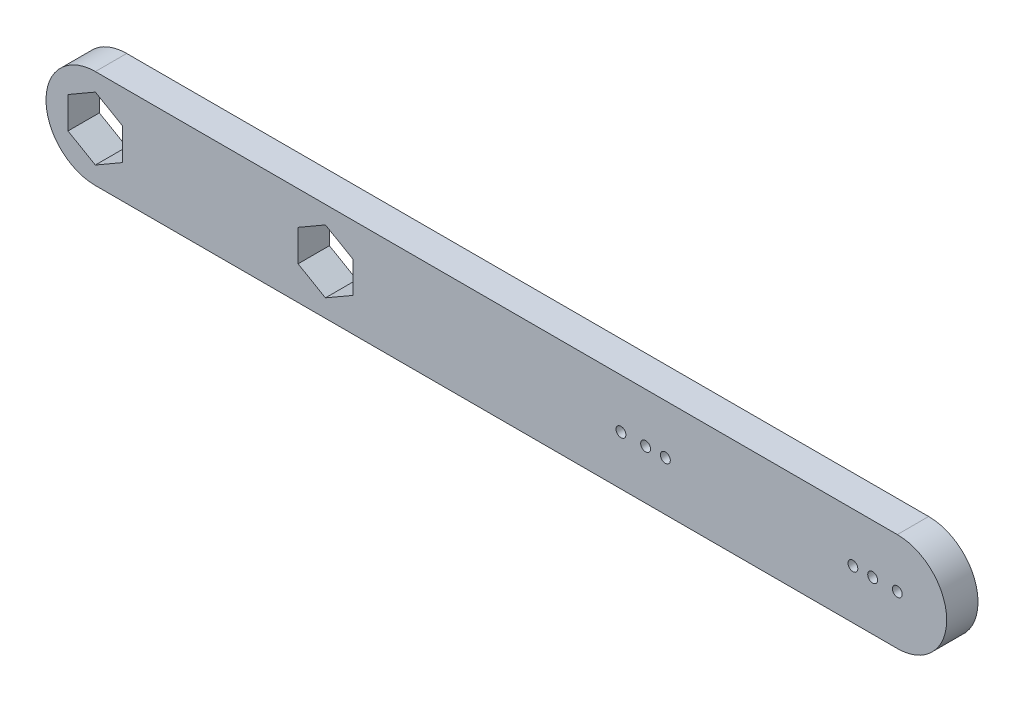
ISO-10303-21;
HEADER;
FILE_DESCRIPTION(('STEP AP214'),'2;1');
FILE_NAME('part.step','',(''),(''),'','','');
FILE_SCHEMA(('AUTOMOTIVE_DESIGN { 1 0 10303 214 1 1 1 1 }'));
ENDSEC;
DATA;
#1=APPLICATION_CONTEXT('core data for automotive mechanical design processes');
#2=APPLICATION_PROTOCOL_DEFINITION('international standard','automotive_design',2000,#1);
#3=PRODUCT_CONTEXT('',#1,'mechanical');
#4=PRODUCT('Part','Part','',(#3));
#5=PRODUCT_RELATED_PRODUCT_CATEGORY('part','',(#4));
#6=PRODUCT_DEFINITION_FORMATION('','',#4);
#7=PRODUCT_DEFINITION_CONTEXT('part definition',#1,'design');
#8=PRODUCT_DEFINITION('design','',#6,#7);
#9=PRODUCT_DEFINITION_SHAPE('','',#8);
#10=(LENGTH_UNIT() NAMED_UNIT(*) SI_UNIT(.MILLI.,.METRE.));
#11=(NAMED_UNIT(*) PLANE_ANGLE_UNIT() SI_UNIT($,.RADIAN.));
#12=(NAMED_UNIT(*) SI_UNIT($,.STERADIAN.) SOLID_ANGLE_UNIT());
#13=UNCERTAINTY_MEASURE_WITH_UNIT(LENGTH_MEASURE(1.E-05),#10,'distance_accuracy_value','');
#14=(GEOMETRIC_REPRESENTATION_CONTEXT(3) GLOBAL_UNCERTAINTY_ASSIGNED_CONTEXT((#13)) GLOBAL_UNIT_ASSIGNED_CONTEXT((#10,
#11,#12)) REPRESENTATION_CONTEXT('',''));
#15=CARTESIAN_POINT('',(0.,0.,0.));
#16=DIRECTION('',(0.,0.,1.));
#17=DIRECTION('',(1.,0.,0.));
#18=AXIS2_PLACEMENT_3D('',#15,#16,#17);
#19=CARTESIAN_POINT('',(0.,0.,3.175));
#20=DIRECTION('',(0.,0.,1.));
#21=DIRECTION('',(1.,0.,0.));
#22=AXIS2_PLACEMENT_3D('',#19,#20,#21);
#23=PLANE('',#22);
#24=CARTESIAN_POINT('',(55.75,0.,3.175));
#25=DIRECTION('',(0.,0.,1.));
#26=DIRECTION('',(1.,0.,0.));
#27=AXIS2_PLACEMENT_3D('',#24,#25,#26);
#28=CIRCLE('',#27,0.499999999999999);
#29=CARTESIAN_POINT('',(56.25,0.,3.175));
#30=VERTEX_POINT('',#29);
#31=EDGE_CURVE('E466',#30,#30,#28,.T.);
#32=ORIENTED_EDGE('',*,*,#31,.F.);
#33=EDGE_LOOP('',(#32));
#34=FACE_BOUND('',#33,.T.);
#35=CARTESIAN_POINT('',(57.75,0.,3.175));
#36=DIRECTION('',(0.,0.,1.));
#37=DIRECTION('',(1.,0.,0.));
#38=AXIS2_PLACEMENT_3D('',#35,#36,#37);
#39=CIRCLE('',#38,0.499999999999999);
#40=CARTESIAN_POINT('',(58.25,0.,3.175));
#41=VERTEX_POINT('',#40);
#42=EDGE_CURVE('E482',#41,#41,#39,.T.);
#43=ORIENTED_EDGE('',*,*,#42,.F.);
#44=EDGE_LOOP('',(#43));
#45=FACE_BOUND('',#44,.T.);
#46=CARTESIAN_POINT('',(81.25,0.,3.175));
#47=DIRECTION('',(0.,0.,1.));
#48=DIRECTION('',(1.,0.,0.));
#49=AXIS2_PLACEMENT_3D('',#46,#47,#48);
#50=CIRCLE('',#49,0.499999999999999);
#51=CARTESIAN_POINT('',(81.75,0.,3.175));
#52=VERTEX_POINT('',#51);
#53=EDGE_CURVE('E195',#52,#52,#50,.T.);
#54=ORIENTED_EDGE('',*,*,#53,.F.);
#55=EDGE_LOOP('',(#54));
#56=FACE_BOUND('',#55,.T.);
#57=CARTESIAN_POINT('',(0.,0.,3.175));
#58=DIRECTION('',(0.,0.,1.));
#59=DIRECTION('',(1.,0.,0.));
#60=AXIS2_PLACEMENT_3D('',#57,#58,#59);
#61=CIRCLE('',#60,4.99999999999998);
#62=CARTESIAN_POINT('',(0.,4.99999999999998,3.175));
#63=VERTEX_POINT('',#62);
#64=CARTESIAN_POINT('',(0.,-4.99999999999998,3.175));
#65=VERTEX_POINT('',#64);
#66=EDGE_CURVE('E288',#63,#65,#61,.T.);
#67=ORIENTED_EDGE('',*,*,#66,.T.);
#68=DIRECTION('',(1.,0.,0.));
#69=VECTOR('',#68,1.);
#70=CARTESIAN_POINT('',(0.,-4.99999999999998,3.175));
#71=LINE('',#70,#69);
#72=CARTESIAN_POINT('',(81.25,-5.,3.175));
#73=VERTEX_POINT('',#72);
#74=EDGE_CURVE('E292',#65,#73,#71,.T.);
#75=ORIENTED_EDGE('',*,*,#74,.T.);
#76=CARTESIAN_POINT('',(81.25,0.,3.175));
#77=DIRECTION('',(0.,0.,1.));
#78=DIRECTION('',(1.,0.,0.));
#79=AXIS2_PLACEMENT_3D('',#76,#77,#78);
#80=CIRCLE('',#79,5.);
#81=CARTESIAN_POINT('',(81.25,5.,3.175));
#82=VERTEX_POINT('',#81);
#83=EDGE_CURVE('E296',#73,#82,#80,.T.);
#84=ORIENTED_EDGE('',*,*,#83,.T.);
#85=DIRECTION('',(-1.,0.,0.));
#86=VECTOR('',#85,1.);
#87=CARTESIAN_POINT('',(0.,4.99999999999998,3.175));
#88=LINE('',#87,#86);
#89=EDGE_CURVE('E299',#82,#63,#88,.T.);
#90=ORIENTED_EDGE('',*,*,#89,.T.);
#91=EDGE_LOOP('',(#67,#75,#84,#90));
#92=FACE_BOUND('',#91,.T.);
#93=DIRECTION('',(-0.866025403784439,-0.5,0.));
#94=VECTOR('',#93,1.);
#95=CARTESIAN_POINT('',(0.,3.2,3.175));
#96=LINE('',#95,#94);
#97=CARTESIAN_POINT('',(0.,3.2,3.175));
#98=VERTEX_POINT('',#97);
#99=CARTESIAN_POINT('',(-2.7712812921102,1.6,3.175));
#100=VERTEX_POINT('',#99);
#101=EDGE_CURVE('E228',#98,#100,#96,.T.);
#102=ORIENTED_EDGE('',*,*,#101,.F.);
#103=DIRECTION('',(-0.866025403784439,0.5,0.));
#104=VECTOR('',#103,1.);
#105=CARTESIAN_POINT('',(2.7712812921102,1.6,3.175));
#106=LINE('',#105,#104);
#107=CARTESIAN_POINT('',(2.7712812921102,1.6,3.175));
#108=VERTEX_POINT('',#107);
#109=EDGE_CURVE('E225',#108,#98,#106,.T.);
#110=ORIENTED_EDGE('',*,*,#109,.F.);
#111=DIRECTION('',(0.,1.,0.));
#112=VECTOR('',#111,1.);
#113=CARTESIAN_POINT('',(2.77128129211021,-1.6,3.175));
#114=LINE('',#113,#112);
#115=CARTESIAN_POINT('',(2.77128129211021,-1.6,3.175));
#116=VERTEX_POINT('',#115);
#117=EDGE_CURVE('E242',#116,#108,#114,.T.);
#118=ORIENTED_EDGE('',*,*,#117,.F.);
#119=DIRECTION('',(0.866025403784439,0.5,0.));
#120=VECTOR('',#119,1.);
#121=CARTESIAN_POINT('',(0.,-3.2,3.175));
#122=LINE('',#121,#120);
#123=CARTESIAN_POINT('',(0.,-3.2,3.175));
#124=VERTEX_POINT('',#123);
#125=EDGE_CURVE('E238',#124,#116,#122,.T.);
#126=ORIENTED_EDGE('',*,*,#125,.F.);
#127=DIRECTION('',(0.866025403784439,-0.5,0.));
#128=VECTOR('',#127,1.);
#129=CARTESIAN_POINT('',(-2.7712812921102,-1.6,3.175));
#130=LINE('',#129,#128);
#131=CARTESIAN_POINT('',(-2.7712812921102,-1.6,3.175));
#132=VERTEX_POINT('',#131);
#133=EDGE_CURVE('E235',#132,#124,#130,.T.);
#134=ORIENTED_EDGE('',*,*,#133,.F.);
#135=DIRECTION('',(0.,-1.,0.));
#136=VECTOR('',#135,1.);
#137=CARTESIAN_POINT('',(-2.7712812921102,1.6,3.175));
#138=LINE('',#137,#136);
#139=EDGE_CURVE('E232',#100,#132,#138,.T.);
#140=ORIENTED_EDGE('',*,*,#139,.F.);
#141=EDGE_LOOP('',(#102,#110,#118,#126,#134,#140));
#142=FACE_BOUND('',#141,.T.);
#143=DIRECTION('',(-0.866025403784439,0.5,0.));
#144=VECTOR('',#143,1.);
#145=CARTESIAN_POINT('',(26.0812812921102,1.6,3.175));
#146=LINE('',#145,#144);
#147=CARTESIAN_POINT('',(26.0812812921102,1.6,3.175));
#148=VERTEX_POINT('',#147);
#149=CARTESIAN_POINT('',(23.31,3.2,3.175));
#150=VERTEX_POINT('',#149);
#151=EDGE_CURVE('E162',#148,#150,#146,.T.);
#152=ORIENTED_EDGE('',*,*,#151,.F.);
#153=DIRECTION('',(0.,1.,0.));
#154=VECTOR('',#153,1.);
#155=CARTESIAN_POINT('',(26.0812812921102,-1.60000000000001,3.175));
#156=LINE('',#155,#154);
#157=CARTESIAN_POINT('',(26.0812812921102,-1.60000000000001,3.175));
#158=VERTEX_POINT('',#157);
#159=EDGE_CURVE('E153',#158,#148,#156,.T.);
#160=ORIENTED_EDGE('',*,*,#159,.F.);
#161=DIRECTION('',(0.866025403784439,0.5,0.));
#162=VECTOR('',#161,1.);
#163=CARTESIAN_POINT('',(23.31,-3.20000000000001,3.175));
#164=LINE('',#163,#162);
#165=CARTESIAN_POINT('',(23.31,-3.20000000000001,3.175));
#166=VERTEX_POINT('',#165);
#167=EDGE_CURVE('E190',#166,#158,#164,.T.);
#168=ORIENTED_EDGE('',*,*,#167,.F.);
#169=DIRECTION('',(0.866025403784438,-0.5,0.));
#170=VECTOR('',#169,1.);
#171=CARTESIAN_POINT('',(20.5387187078898,-1.6,3.175));
#172=LINE('',#171,#170);
#173=CARTESIAN_POINT('',(20.5387187078898,-1.6,3.175));
#174=VERTEX_POINT('',#173);
#175=EDGE_CURVE('E187',#174,#166,#172,.T.);
#176=ORIENTED_EDGE('',*,*,#175,.F.);
#177=DIRECTION('',(0.,-1.,0.));
#178=VECTOR('',#177,1.);
#179=CARTESIAN_POINT('',(20.5387187078898,1.6,3.175));
#180=LINE('',#179,#178);
#181=CARTESIAN_POINT('',(20.5387187078898,1.6,3.175));
#182=VERTEX_POINT('',#181);
#183=EDGE_CURVE('E181',#182,#174,#180,.T.);
#184=ORIENTED_EDGE('',*,*,#183,.F.);
#185=DIRECTION('',(-0.866025403784439,-0.5,0.));
#186=VECTOR('',#185,1.);
#187=CARTESIAN_POINT('',(23.31,3.2,3.175));
#188=LINE('',#187,#186);
#189=EDGE_CURVE('E177',#150,#182,#188,.T.);
#190=ORIENTED_EDGE('',*,*,#189,.F.);
#191=EDGE_LOOP('',(#152,#160,#168,#176,#184,#190));
#192=FACE_BOUND('',#191,.T.);
#193=CARTESIAN_POINT('',(53.25,0.,3.175));
#194=DIRECTION('',(0.,0.,1.));
#195=DIRECTION('',(1.,0.,0.));
#196=AXIS2_PLACEMENT_3D('',#193,#194,#195);
#197=CIRCLE('',#196,0.499999999999999);
#198=CARTESIAN_POINT('',(53.75,0.,3.175));
#199=VERTEX_POINT('',#198);
#200=EDGE_CURVE('E490',#199,#199,#197,.T.);
#201=ORIENTED_EDGE('',*,*,#200,.F.);
#202=EDGE_LOOP('',(#201));
#203=FACE_BOUND('',#202,.T.);
#204=CARTESIAN_POINT('',(78.75,0.,3.175));
#205=DIRECTION('',(0.,0.,1.));
#206=DIRECTION('',(1.,0.,0.));
#207=AXIS2_PLACEMENT_3D('',#204,#205,#206);
#208=CIRCLE('',#207,0.499999999999999);
#209=CARTESIAN_POINT('',(79.25,0.,3.175));
#210=VERTEX_POINT('',#209);
#211=EDGE_CURVE('E474',#210,#210,#208,.T.);
#212=ORIENTED_EDGE('',*,*,#211,.F.);
#213=EDGE_LOOP('',(#212));
#214=FACE_BOUND('',#213,.T.);
#215=CARTESIAN_POINT('',(76.75,0.,3.175));
#216=DIRECTION('',(0.,0.,1.));
#217=DIRECTION('',(1.,0.,0.));
#218=AXIS2_PLACEMENT_3D('',#215,#216,#217);
#219=CIRCLE('',#218,0.499999999999999);
#220=CARTESIAN_POINT('',(77.25,0.,3.175));
#221=VERTEX_POINT('',#220);
#222=EDGE_CURVE('E455',#221,#221,#219,.T.);
#223=ORIENTED_EDGE('',*,*,#222,.F.);
#224=EDGE_LOOP('',(#223));
#225=FACE_BOUND('',#224,.T.);
#226=ADVANCED_FACE('F39',(#34,#45,#56,#92,#142,#192,#203,#214,#225),#23,.T.);
#227=CARTESIAN_POINT('',(0.,0.,0.));
#228=DIRECTION('',(0.,0.,1.));
#229=DIRECTION('',(1.,0.,0.));
#230=AXIS2_PLACEMENT_3D('',#227,#228,#229);
#231=PLANE('',#230);
#232=DIRECTION('',(-0.866025403784439,0.5,0.));
#233=VECTOR('',#232,1.);
#234=CARTESIAN_POINT('',(2.7712812921102,1.6,0.));
#235=LINE('',#234,#233);
#236=CARTESIAN_POINT('',(2.7712812921102,1.6,0.));
#237=VERTEX_POINT('',#236);
#238=CARTESIAN_POINT('',(0.,3.2,0.));
#239=VERTEX_POINT('',#238);
#240=EDGE_CURVE('E171',#237,#239,#235,.T.);
#241=ORIENTED_EDGE('',*,*,#240,.T.);
#242=DIRECTION('',(-0.866025403784439,-0.5,0.));
#243=VECTOR('',#242,1.);
#244=CARTESIAN_POINT('',(0.,3.2,0.));
#245=LINE('',#244,#243);
#246=CARTESIAN_POINT('',(-2.7712812921102,1.6,0.));
#247=VERTEX_POINT('',#246);
#248=EDGE_CURVE('E249',#239,#247,#245,.T.);
#249=ORIENTED_EDGE('',*,*,#248,.T.);
#250=DIRECTION('',(0.,-1.,0.));
#251=VECTOR('',#250,1.);
#252=CARTESIAN_POINT('',(-2.7712812921102,1.6,0.));
#253=LINE('',#252,#251);
#254=CARTESIAN_POINT('',(-2.7712812921102,-1.6,0.));
#255=VERTEX_POINT('',#254);
#256=EDGE_CURVE('E253',#247,#255,#253,.T.);
#257=ORIENTED_EDGE('',*,*,#256,.T.);
#258=DIRECTION('',(0.866025403784439,-0.5,0.));
#259=VECTOR('',#258,1.);
#260=CARTESIAN_POINT('',(-2.7712812921102,-1.6,0.));
#261=LINE('',#260,#259);
#262=CARTESIAN_POINT('',(0.,-3.2,0.));
#263=VERTEX_POINT('',#262);
#264=EDGE_CURVE('E257',#255,#263,#261,.T.);
#265=ORIENTED_EDGE('',*,*,#264,.T.);
#266=DIRECTION('',(0.866025403784439,0.5,0.));
#267=VECTOR('',#266,1.);
#268=CARTESIAN_POINT('',(0.,-3.2,0.));
#269=LINE('',#268,#267);
#270=CARTESIAN_POINT('',(2.77128129211021,-1.6,0.));
#271=VERTEX_POINT('',#270);
#272=EDGE_CURVE('E261',#263,#271,#269,.T.);
#273=ORIENTED_EDGE('',*,*,#272,.T.);
#274=DIRECTION('',(0.,1.,0.));
#275=VECTOR('',#274,1.);
#276=CARTESIAN_POINT('',(2.77128129211021,-1.6,0.));
#277=LINE('',#276,#275);
#278=EDGE_CURVE('E229',#271,#237,#277,.T.);
#279=ORIENTED_EDGE('',*,*,#278,.T.);
#280=EDGE_LOOP('',(#241,#249,#257,#265,#273,#279));
#281=FACE_BOUND('',#280,.T.);
#282=CARTESIAN_POINT('',(0.,0.,0.));
#283=DIRECTION('',(0.,0.,1.));
#284=DIRECTION('',(1.,0.,0.));
#285=AXIS2_PLACEMENT_3D('',#282,#283,#284);
#286=CIRCLE('',#285,4.99999999999998);
#287=CARTESIAN_POINT('',(0.,4.99999999999998,0.));
#288=VERTEX_POINT('',#287);
#289=CARTESIAN_POINT('',(0.,-4.99999999999998,0.));
#290=VERTEX_POINT('',#289);
#291=EDGE_CURVE('E287',#288,#290,#286,.T.);
#292=ORIENTED_EDGE('',*,*,#291,.F.);
#293=DIRECTION('',(-1.,0.,0.));
#294=VECTOR('',#293,1.);
#295=CARTESIAN_POINT('',(0.,4.99999999999998,0.));
#296=LINE('',#295,#294);
#297=CARTESIAN_POINT('',(81.25,5.,0.));
#298=VERTEX_POINT('',#297);
#299=EDGE_CURVE('E293',#298,#288,#296,.T.);
#300=ORIENTED_EDGE('',*,*,#299,.F.);
#301=CARTESIAN_POINT('',(81.25,0.,0.));
#302=DIRECTION('',(0.,0.,1.));
#303=DIRECTION('',(1.,0.,0.));
#304=AXIS2_PLACEMENT_3D('',#301,#302,#303);
#305=CIRCLE('',#304,5.);
#306=CARTESIAN_POINT('',(81.25,-5.,0.));
#307=VERTEX_POINT('',#306);
#308=EDGE_CURVE('E309',#307,#298,#305,.T.);
#309=ORIENTED_EDGE('',*,*,#308,.F.);
#310=DIRECTION('',(1.,0.,0.));
#311=VECTOR('',#310,1.);
#312=CARTESIAN_POINT('',(0.,-4.99999999999998,0.));
#313=LINE('',#312,#311);
#314=EDGE_CURVE('E306',#290,#307,#313,.T.);
#315=ORIENTED_EDGE('',*,*,#314,.F.);
#316=EDGE_LOOP('',(#292,#300,#309,#315));
#317=FACE_BOUND('',#316,.T.);
#318=DIRECTION('',(0.,1.,0.));
#319=VECTOR('',#318,1.);
#320=CARTESIAN_POINT('',(26.0812812921102,-1.60000000000001,0.));
#321=LINE('',#320,#319);
#322=CARTESIAN_POINT('',(26.0812812921102,-1.60000000000001,0.));
#323=VERTEX_POINT('',#322);
#324=CARTESIAN_POINT('',(26.0812812921102,1.6,0.));
#325=VERTEX_POINT('',#324);
#326=EDGE_CURVE('E63',#323,#325,#321,.T.);
#327=ORIENTED_EDGE('',*,*,#326,.T.);
#328=DIRECTION('',(-0.866025403784439,0.5,0.));
#329=VECTOR('',#328,1.);
#330=CARTESIAN_POINT('',(26.0812812921102,1.6,0.));
#331=LINE('',#330,#329);
#332=CARTESIAN_POINT('',(23.31,3.2,0.));
#333=VERTEX_POINT('',#332);
#334=EDGE_CURVE('E169',#325,#333,#331,.T.);
#335=ORIENTED_EDGE('',*,*,#334,.T.);
#336=DIRECTION('',(-0.866025403784439,-0.5,0.));
#337=VECTOR('',#336,1.);
#338=CARTESIAN_POINT('',(23.31,3.2,0.));
#339=LINE('',#338,#337);
#340=CARTESIAN_POINT('',(20.5387187078898,1.6,0.));
#341=VERTEX_POINT('',#340);
#342=EDGE_CURVE('E198',#333,#341,#339,.T.);
#343=ORIENTED_EDGE('',*,*,#342,.T.);
#344=DIRECTION('',(0.,-1.,0.));
#345=VECTOR('',#344,1.);
#346=CARTESIAN_POINT('',(20.5387187078898,1.6,0.));
#347=LINE('',#346,#345);
#348=CARTESIAN_POINT('',(20.5387187078898,-1.6,0.));
#349=VERTEX_POINT('',#348);
#350=EDGE_CURVE('E202',#341,#349,#347,.T.);
#351=ORIENTED_EDGE('',*,*,#350,.T.);
#352=DIRECTION('',(0.866025403784438,-0.5,0.));
#353=VECTOR('',#352,1.);
#354=CARTESIAN_POINT('',(20.5387187078898,-1.6,0.));
#355=LINE('',#354,#353);
#356=CARTESIAN_POINT('',(23.31,-3.20000000000001,0.));
#357=VERTEX_POINT('',#356);
#358=EDGE_CURVE('E206',#349,#357,#355,.T.);
#359=ORIENTED_EDGE('',*,*,#358,.T.);
#360=DIRECTION('',(0.866025403784439,0.5,0.));
#361=VECTOR('',#360,1.);
#362=CARTESIAN_POINT('',(23.31,-3.20000000000001,0.));
#363=LINE('',#362,#361);
#364=EDGE_CURVE('E163',#357,#323,#363,.T.);
#365=ORIENTED_EDGE('',*,*,#364,.T.);
#366=EDGE_LOOP('',(#327,#335,#343,#351,#359,#365));
#367=FACE_BOUND('',#366,.T.);
#368=CARTESIAN_POINT('',(81.25,0.,0.));
#369=DIRECTION('',(0.,0.,1.));
#370=DIRECTION('',(1.,0.,0.));
#371=AXIS2_PLACEMENT_3D('',#368,#369,#370);
#372=CIRCLE('',#371,0.499999999999999);
#373=CARTESIAN_POINT('',(81.75,0.,0.));
#374=VERTEX_POINT('',#373);
#375=EDGE_CURVE('E494',#374,#374,#372,.T.);
#376=ORIENTED_EDGE('',*,*,#375,.T.);
#377=EDGE_LOOP('',(#376));
#378=FACE_BOUND('',#377,.T.);
#379=CARTESIAN_POINT('',(53.25,0.,0.));
#380=DIRECTION('',(0.,0.,1.));
#381=DIRECTION('',(1.,0.,0.));
#382=AXIS2_PLACEMENT_3D('',#379,#380,#381);
#383=CIRCLE('',#382,0.499999999999999);
#384=CARTESIAN_POINT('',(53.75,0.,0.));
#385=VERTEX_POINT('',#384);
#386=EDGE_CURVE('E486',#385,#385,#383,.T.);
#387=ORIENTED_EDGE('',*,*,#386,.T.);
#388=EDGE_LOOP('',(#387));
#389=FACE_BOUND('',#388,.T.);
#390=CARTESIAN_POINT('',(57.75,0.,0.));
#391=DIRECTION('',(0.,0.,1.));
#392=DIRECTION('',(1.,0.,0.));
#393=AXIS2_PLACEMENT_3D('',#390,#391,#392);
#394=CIRCLE('',#393,0.499999999999999);
#395=CARTESIAN_POINT('',(58.25,0.,0.));
#396=VERTEX_POINT('',#395);
#397=EDGE_CURVE('E478',#396,#396,#394,.T.);
#398=ORIENTED_EDGE('',*,*,#397,.T.);
#399=EDGE_LOOP('',(#398));
#400=FACE_BOUND('',#399,.T.);
#401=CARTESIAN_POINT('',(78.75,0.,0.));
#402=DIRECTION('',(0.,0.,1.));
#403=DIRECTION('',(1.,0.,0.));
#404=AXIS2_PLACEMENT_3D('',#401,#402,#403);
#405=CIRCLE('',#404,0.499999999999999);
#406=CARTESIAN_POINT('',(79.25,0.,0.));
#407=VERTEX_POINT('',#406);
#408=EDGE_CURVE('E470',#407,#407,#405,.T.);
#409=ORIENTED_EDGE('',*,*,#408,.T.);
#410=EDGE_LOOP('',(#409));
#411=FACE_BOUND('',#410,.T.);
#412=CARTESIAN_POINT('',(55.75,0.,0.));
#413=DIRECTION('',(0.,0.,1.));
#414=DIRECTION('',(1.,0.,0.));
#415=AXIS2_PLACEMENT_3D('',#412,#413,#414);
#416=CIRCLE('',#415,0.499999999999999);
#417=CARTESIAN_POINT('',(56.25,0.,0.));
#418=VERTEX_POINT('',#417);
#419=EDGE_CURVE('E463',#418,#418,#416,.T.);
#420=ORIENTED_EDGE('',*,*,#419,.T.);
#421=EDGE_LOOP('',(#420));
#422=FACE_BOUND('',#421,.T.);
#423=CARTESIAN_POINT('',(76.75,0.,0.));
#424=DIRECTION('',(0.,0.,1.));
#425=DIRECTION('',(1.,0.,0.));
#426=AXIS2_PLACEMENT_3D('',#423,#424,#425);
#427=CIRCLE('',#426,0.499999999999999);
#428=CARTESIAN_POINT('',(77.25,0.,0.));
#429=VERTEX_POINT('',#428);
#430=EDGE_CURVE('E458',#429,#429,#427,.T.);
#431=ORIENTED_EDGE('',*,*,#430,.T.);
#432=EDGE_LOOP('',(#431));
#433=FACE_BOUND('',#432,.T.);
#434=ADVANCED_FACE('F332',(#281,#317,#367,#378,#389,#400,#411,#422,#433),#231,.F.);
#435=CARTESIAN_POINT('',(0.,0.,3.175));
#436=DIRECTION('',(0.,0.,-1.));
#437=DIRECTION('',(-1.,0.,0.));
#438=AXIS2_PLACEMENT_3D('',#435,#436,#437);
#439=CYLINDRICAL_SURFACE('',#438,4.99999999999998);
#440=ORIENTED_EDGE('',*,*,#291,.T.);
#441=DIRECTION('',(0.,0.,-1.));
#442=VECTOR('',#441,1.);
#443=CARTESIAN_POINT('',(0.,-4.99999999999998,3.175));
#444=LINE('',#443,#442);
#445=EDGE_CURVE('E11',#65,#290,#444,.T.);
#446=ORIENTED_EDGE('',*,*,#445,.F.);
#447=ORIENTED_EDGE('',*,*,#66,.F.);
#448=DIRECTION('',(0.,0.,-1.));
#449=VECTOR('',#448,1.);
#450=CARTESIAN_POINT('',(0.,4.99999999999998,3.175));
#451=LINE('',#450,#449);
#452=EDGE_CURVE('E302',#63,#288,#451,.T.);
#453=ORIENTED_EDGE('',*,*,#452,.T.);
#454=EDGE_LOOP('',(#440,#446,#447,#453));
#455=FACE_BOUND('',#454,.T.);
#456=ADVANCED_FACE('F41',(#455),#439,.T.);
#457=CARTESIAN_POINT('',(0.,-4.99999999999998,3.175));
#458=DIRECTION('',(0.,1.,0.));
#459=DIRECTION('',(-1.,0.,0.));
#460=AXIS2_PLACEMENT_3D('',#457,#458,#459);
#461=PLANE('',#460);
#462=ORIENTED_EDGE('',*,*,#314,.T.);
#463=DIRECTION('',(0.,0.,-1.));
#464=VECTOR('',#463,1.);
#465=CARTESIAN_POINT('',(81.25,-5.,3.175));
#466=LINE('',#465,#464);
#467=EDGE_CURVE('E48',#73,#307,#466,.T.);
#468=ORIENTED_EDGE('',*,*,#467,.F.);
#469=ORIENTED_EDGE('',*,*,#74,.F.);
#470=ORIENTED_EDGE('',*,*,#445,.T.);
#471=EDGE_LOOP('',(#462,#468,#469,#470));
#472=FACE_BOUND('',#471,.T.);
#473=ADVANCED_FACE('F343',(#472),#461,.F.);
#474=CARTESIAN_POINT('',(81.25,0.,3.175));
#475=DIRECTION('',(0.,0.,-1.));
#476=DIRECTION('',(-1.,0.,0.));
#477=AXIS2_PLACEMENT_3D('',#474,#475,#476);
#478=CYLINDRICAL_SURFACE('',#477,5.);
#479=ORIENTED_EDGE('',*,*,#308,.T.);
#480=DIRECTION('',(0.,0.,-1.));
#481=VECTOR('',#480,1.);
#482=CARTESIAN_POINT('',(81.25,5.,3.175));
#483=LINE('',#482,#481);
#484=EDGE_CURVE('E317',#82,#298,#483,.T.);
#485=ORIENTED_EDGE('',*,*,#484,.F.);
#486=ORIENTED_EDGE('',*,*,#83,.F.);
#487=ORIENTED_EDGE('',*,*,#467,.T.);
#488=EDGE_LOOP('',(#479,#485,#486,#487));
#489=FACE_BOUND('',#488,.T.);
#490=ADVANCED_FACE('F326',(#489),#478,.T.);
#491=CARTESIAN_POINT('',(0.,4.99999999999998,3.175));
#492=DIRECTION('',(0.,-1.,0.));
#493=DIRECTION('',(1.,0.,0.));
#494=AXIS2_PLACEMENT_3D('',#491,#492,#493);
#495=PLANE('',#494);
#496=ORIENTED_EDGE('',*,*,#299,.T.);
#497=ORIENTED_EDGE('',*,*,#452,.F.);
#498=ORIENTED_EDGE('',*,*,#89,.F.);
#499=ORIENTED_EDGE('',*,*,#484,.T.);
#500=EDGE_LOOP('',(#496,#497,#498,#499));
#501=FACE_BOUND('',#500,.T.);
#502=ADVANCED_FACE('F336',(#501),#495,.F.);
#503=CARTESIAN_POINT('',(2.7712812921102,1.6,3.175));
#504=DIRECTION('',(-0.5,-0.866025403784439,0.));
#505=DIRECTION('',(0.866025403784439,-0.5,0.));
#506=AXIS2_PLACEMENT_3D('',#503,#504,#505);
#507=PLANE('',#506);
#508=ORIENTED_EDGE('',*,*,#240,.F.);
#509=DIRECTION('',(0.,0.,-1.));
#510=VECTOR('',#509,1.);
#511=CARTESIAN_POINT('',(2.7712812921102,1.6,3.175));
#512=LINE('',#511,#510);
#513=EDGE_CURVE('E245',#108,#237,#512,.T.);
#514=ORIENTED_EDGE('',*,*,#513,.F.);
#515=ORIENTED_EDGE('',*,*,#109,.T.);
#516=DIRECTION('',(0.,0.,-1.));
#517=VECTOR('',#516,1.);
#518=CARTESIAN_POINT('',(0.,3.2,3.175));
#519=LINE('',#518,#517);
#520=EDGE_CURVE('E283',#98,#239,#519,.T.);
#521=ORIENTED_EDGE('',*,*,#520,.T.);
#522=EDGE_LOOP('',(#508,#514,#515,#521));
#523=FACE_BOUND('',#522,.T.);
#524=ADVANCED_FACE('F361',(#523),#507,.T.);
#525=CARTESIAN_POINT('',(0.,3.2,3.175));
#526=DIRECTION('',(0.5,-0.866025403784438,0.));
#527=DIRECTION('',(0.866025403784439,0.5,0.));
#528=AXIS2_PLACEMENT_3D('',#525,#526,#527);
#529=PLANE('',#528);
#530=ORIENTED_EDGE('',*,*,#248,.F.);
#531=ORIENTED_EDGE('',*,*,#520,.F.);
#532=ORIENTED_EDGE('',*,*,#101,.T.);
#533=DIRECTION('',(0.,0.,-1.));
#534=VECTOR('',#533,1.);
#535=CARTESIAN_POINT('',(-2.7712812921102,1.6,3.175));
#536=LINE('',#535,#534);
#537=EDGE_CURVE('E280',#100,#247,#536,.T.);
#538=ORIENTED_EDGE('',*,*,#537,.T.);
#539=EDGE_LOOP('',(#530,#531,#532,#538));
#540=FACE_BOUND('',#539,.T.);
#541=ADVANCED_FACE('F368',(#540),#529,.T.);
#542=CARTESIAN_POINT('',(-2.7712812921102,1.6,3.175));
#543=DIRECTION('',(1.,0.,0.));
#544=DIRECTION('',(0.,1.,0.));
#545=AXIS2_PLACEMENT_3D('',#542,#543,#544);
#546=PLANE('',#545);
#547=ORIENTED_EDGE('',*,*,#256,.F.);
#548=ORIENTED_EDGE('',*,*,#537,.F.);
#549=ORIENTED_EDGE('',*,*,#139,.T.);
#550=DIRECTION('',(0.,0.,-1.));
#551=VECTOR('',#550,1.);
#552=CARTESIAN_POINT('',(-2.7712812921102,-1.6,3.175));
#553=LINE('',#552,#551);
#554=EDGE_CURVE('E277',#132,#255,#553,.T.);
#555=ORIENTED_EDGE('',*,*,#554,.T.);
#556=EDGE_LOOP('',(#547,#548,#549,#555));
#557=FACE_BOUND('',#556,.T.);
#558=ADVANCED_FACE('F373',(#557),#546,.T.);
#559=CARTESIAN_POINT('',(-2.7712812921102,-1.6,3.175));
#560=DIRECTION('',(0.5,0.866025403784439,0.));
#561=DIRECTION('',(-0.866025403784439,0.5,0.));
#562=AXIS2_PLACEMENT_3D('',#559,#560,#561);
#563=PLANE('',#562);
#564=ORIENTED_EDGE('',*,*,#264,.F.);
#565=ORIENTED_EDGE('',*,*,#554,.F.);
#566=ORIENTED_EDGE('',*,*,#133,.T.);
#567=DIRECTION('',(0.,0.,-1.));
#568=VECTOR('',#567,1.);
#569=CARTESIAN_POINT('',(0.,-3.2,3.175));
#570=LINE('',#569,#568);
#571=EDGE_CURVE('E274',#124,#263,#570,.T.);
#572=ORIENTED_EDGE('',*,*,#571,.T.);
#573=EDGE_LOOP('',(#564,#565,#566,#572));
#574=FACE_BOUND('',#573,.T.);
#575=ADVANCED_FACE('F396',(#574),#563,.T.);
#576=CARTESIAN_POINT('',(0.,-3.2,3.175));
#577=DIRECTION('',(-0.5,0.866025403784439,0.));
#578=DIRECTION('',(-0.866025403784439,-0.5,0.));
#579=AXIS2_PLACEMENT_3D('',#576,#577,#578);
#580=PLANE('',#579);
#581=ORIENTED_EDGE('',*,*,#272,.F.);
#582=ORIENTED_EDGE('',*,*,#571,.F.);
#583=ORIENTED_EDGE('',*,*,#125,.T.);
#584=DIRECTION('',(0.,0.,-1.));
#585=VECTOR('',#584,1.);
#586=CARTESIAN_POINT('',(2.77128129211021,-1.6,3.175));
#587=LINE('',#586,#585);
#588=EDGE_CURVE('E271',#116,#271,#587,.T.);
#589=ORIENTED_EDGE('',*,*,#588,.T.);
#590=EDGE_LOOP('',(#581,#582,#583,#589));
#591=FACE_BOUND('',#590,.T.);
#592=ADVANCED_FACE('F386',(#591),#580,.T.);
#593=CARTESIAN_POINT('',(2.77128129211021,-1.6,3.175));
#594=DIRECTION('',(-1.,0.,0.));
#595=DIRECTION('',(0.,-1.,0.));
#596=AXIS2_PLACEMENT_3D('',#593,#594,#595);
#597=PLANE('',#596);
#598=ORIENTED_EDGE('',*,*,#278,.F.);
#599=ORIENTED_EDGE('',*,*,#588,.F.);
#600=ORIENTED_EDGE('',*,*,#117,.T.);
#601=ORIENTED_EDGE('',*,*,#513,.T.);
#602=EDGE_LOOP('',(#598,#599,#600,#601));
#603=FACE_BOUND('',#602,.T.);
#604=ADVANCED_FACE('F380',(#603),#597,.T.);
#605=CARTESIAN_POINT('',(26.0812812921102,-1.60000000000001,3.175));
#606=DIRECTION('',(-1.,0.,0.));
#607=DIRECTION('',(0.,0.,1.));
#608=AXIS2_PLACEMENT_3D('',#605,#606,#607);
#609=PLANE('',#608);
#610=ORIENTED_EDGE('',*,*,#326,.F.);
#611=DIRECTION('',(0.,0.,-1.));
#612=VECTOR('',#611,1.);
#613=CARTESIAN_POINT('',(26.0812812921102,-1.60000000000001,3.175));
#614=LINE('',#613,#612);
#615=EDGE_CURVE('E157',#158,#323,#614,.T.);
#616=ORIENTED_EDGE('',*,*,#615,.F.);
#617=ORIENTED_EDGE('',*,*,#159,.T.);
#618=DIRECTION('',(0.,0.,-1.));
#619=VECTOR('',#618,1.);
#620=CARTESIAN_POINT('',(26.0812812921102,1.6,3.175));
#621=LINE('',#620,#619);
#622=EDGE_CURVE('E156',#148,#325,#621,.T.);
#623=ORIENTED_EDGE('',*,*,#622,.T.);
#624=EDGE_LOOP('',(#610,#616,#617,#623));
#625=FACE_BOUND('',#624,.T.);
#626=ADVANCED_FACE('F155',(#625),#609,.T.);
#627=CARTESIAN_POINT('',(26.0812812921102,1.6,3.175));
#628=DIRECTION('',(-0.5,-0.866025403784439,0.));
#629=DIRECTION('',(0.866025403784439,-0.5,0.));
#630=AXIS2_PLACEMENT_3D('',#627,#628,#629);
#631=PLANE('',#630);
#632=ORIENTED_EDGE('',*,*,#334,.F.);
#633=ORIENTED_EDGE('',*,*,#622,.F.);
#634=ORIENTED_EDGE('',*,*,#151,.T.);
#635=DIRECTION('',(0.,0.,-1.));
#636=VECTOR('',#635,1.);
#637=CARTESIAN_POINT('',(23.31,3.2,3.175));
#638=LINE('',#637,#636);
#639=EDGE_CURVE('E172',#150,#333,#638,.T.);
#640=ORIENTED_EDGE('',*,*,#639,.T.);
#641=EDGE_LOOP('',(#632,#633,#634,#640));
#642=FACE_BOUND('',#641,.T.);
#643=ADVANCED_FACE('F166',(#642),#631,.T.);
#644=CARTESIAN_POINT('',(23.31,3.2,3.175));
#645=DIRECTION('',(0.5,-0.866025403784439,0.));
#646=DIRECTION('',(0.866025403784439,0.5,0.));
#647=AXIS2_PLACEMENT_3D('',#644,#645,#646);
#648=PLANE('',#647);
#649=ORIENTED_EDGE('',*,*,#342,.F.);
#650=ORIENTED_EDGE('',*,*,#639,.F.);
#651=ORIENTED_EDGE('',*,*,#189,.T.);
#652=DIRECTION('',(0.,0.,-1.));
#653=VECTOR('',#652,1.);
#654=CARTESIAN_POINT('',(20.5387187078898,1.6,3.175));
#655=LINE('',#654,#653);
#656=EDGE_CURVE('E220',#182,#341,#655,.T.);
#657=ORIENTED_EDGE('',*,*,#656,.T.);
#658=EDGE_LOOP('',(#649,#650,#651,#657));
#659=FACE_BOUND('',#658,.T.);
#660=ADVANCED_FACE('F412',(#659),#648,.T.);
#661=CARTESIAN_POINT('',(20.5387187078898,1.6,3.175));
#662=DIRECTION('',(1.,0.,0.));
#663=DIRECTION('',(0.,0.,-1.));
#664=AXIS2_PLACEMENT_3D('',#661,#662,#663);
#665=PLANE('',#664);
#666=ORIENTED_EDGE('',*,*,#350,.F.);
#667=ORIENTED_EDGE('',*,*,#656,.F.);
#668=ORIENTED_EDGE('',*,*,#183,.T.);
#669=DIRECTION('',(0.,0.,-1.));
#670=VECTOR('',#669,1.);
#671=CARTESIAN_POINT('',(20.5387187078898,-1.6,3.175));
#672=LINE('',#671,#670);
#673=EDGE_CURVE('E217',#174,#349,#672,.T.);
#674=ORIENTED_EDGE('',*,*,#673,.T.);
#675=EDGE_LOOP('',(#666,#667,#668,#674));
#676=FACE_BOUND('',#675,.T.);
#677=ADVANCED_FACE('F415',(#676),#665,.T.);
#678=CARTESIAN_POINT('',(20.5387187078898,-1.6,3.175));
#679=DIRECTION('',(0.5,0.866025403784439,0.));
#680=DIRECTION('',(-0.866025403784439,0.5,0.));
#681=AXIS2_PLACEMENT_3D('',#678,#679,#680);
#682=PLANE('',#681);
#683=ORIENTED_EDGE('',*,*,#358,.F.);
#684=ORIENTED_EDGE('',*,*,#673,.F.);
#685=ORIENTED_EDGE('',*,*,#175,.T.);
#686=DIRECTION('',(0.,0.,-1.));
#687=VECTOR('',#686,1.);
#688=CARTESIAN_POINT('',(23.31,-3.20000000000001,3.175));
#689=LINE('',#688,#687);
#690=EDGE_CURVE('E55',#166,#357,#689,.T.);
#691=ORIENTED_EDGE('',*,*,#690,.T.);
#692=EDGE_LOOP('',(#683,#684,#685,#691));
#693=FACE_BOUND('',#692,.T.);
#694=ADVANCED_FACE('F419',(#693),#682,.T.);
#695=CARTESIAN_POINT('',(23.31,-3.20000000000001,3.175));
#696=DIRECTION('',(-0.5,0.866025403784439,0.));
#697=DIRECTION('',(-0.866025403784439,-0.5,0.));
#698=AXIS2_PLACEMENT_3D('',#695,#696,#697);
#699=PLANE('',#698);
#700=ORIENTED_EDGE('',*,*,#364,.F.);
#701=ORIENTED_EDGE('',*,*,#690,.F.);
#702=ORIENTED_EDGE('',*,*,#167,.T.);
#703=ORIENTED_EDGE('',*,*,#615,.T.);
#704=EDGE_LOOP('',(#700,#701,#702,#703));
#705=FACE_BOUND('',#704,.T.);
#706=ADVANCED_FACE('F423',(#705),#699,.T.);
#707=CARTESIAN_POINT('',(81.25,0.,3.175));
#708=DIRECTION('',(0.,0.,-1.));
#709=DIRECTION('',(-1.,0.,0.));
#710=AXIS2_PLACEMENT_3D('',#707,#708,#709);
#711=CYLINDRICAL_SURFACE('',#710,0.499999999999999);
#712=ORIENTED_EDGE('',*,*,#53,.T.);
#713=EDGE_LOOP('',(#712));
#714=FACE_BOUND('',#713,.T.);
#715=ORIENTED_EDGE('',*,*,#375,.F.);
#716=EDGE_LOOP('',(#715));
#717=FACE_BOUND('',#716,.T.);
#718=ADVANCED_FACE('F427',(#714,#717),#711,.F.);
#719=CARTESIAN_POINT('',(53.25,0.,3.175));
#720=DIRECTION('',(0.,0.,-1.));
#721=DIRECTION('',(-1.,0.,0.));
#722=AXIS2_PLACEMENT_3D('',#719,#720,#721);
#723=CYLINDRICAL_SURFACE('',#722,0.499999999999999);
#724=ORIENTED_EDGE('',*,*,#200,.T.);
#725=EDGE_LOOP('',(#724));
#726=FACE_BOUND('',#725,.T.);
#727=ORIENTED_EDGE('',*,*,#386,.F.);
#728=EDGE_LOOP('',(#727));
#729=FACE_BOUND('',#728,.T.);
#730=ADVANCED_FACE('F430',(#726,#729),#723,.F.);
#731=CARTESIAN_POINT('',(57.75,0.,3.175));
#732=DIRECTION('',(0.,0.,-1.));
#733=DIRECTION('',(-1.,0.,0.));
#734=AXIS2_PLACEMENT_3D('',#731,#732,#733);
#735=CYLINDRICAL_SURFACE('',#734,0.499999999999999);
#736=ORIENTED_EDGE('',*,*,#42,.T.);
#737=EDGE_LOOP('',(#736));
#738=FACE_BOUND('',#737,.T.);
#739=ORIENTED_EDGE('',*,*,#397,.F.);
#740=EDGE_LOOP('',(#739));
#741=FACE_BOUND('',#740,.T.);
#742=ADVANCED_FACE('F434',(#738,#741),#735,.F.);
#743=CARTESIAN_POINT('',(78.75,0.,3.175));
#744=DIRECTION('',(0.,0.,-1.));
#745=DIRECTION('',(-1.,0.,0.));
#746=AXIS2_PLACEMENT_3D('',#743,#744,#745);
#747=CYLINDRICAL_SURFACE('',#746,0.499999999999999);
#748=ORIENTED_EDGE('',*,*,#211,.T.);
#749=EDGE_LOOP('',(#748));
#750=FACE_BOUND('',#749,.T.);
#751=ORIENTED_EDGE('',*,*,#408,.F.);
#752=EDGE_LOOP('',(#751));
#753=FACE_BOUND('',#752,.T.);
#754=ADVANCED_FACE('F438',(#750,#753),#747,.F.);
#755=CARTESIAN_POINT('',(55.75,0.,3.175));
#756=DIRECTION('',(0.,0.,-1.));
#757=DIRECTION('',(-1.,0.,0.));
#758=AXIS2_PLACEMENT_3D('',#755,#756,#757);
#759=CYLINDRICAL_SURFACE('',#758,0.499999999999999);
#760=ORIENTED_EDGE('',*,*,#31,.T.);
#761=EDGE_LOOP('',(#760));
#762=FACE_BOUND('',#761,.T.);
#763=ORIENTED_EDGE('',*,*,#419,.F.);
#764=EDGE_LOOP('',(#763));
#765=FACE_BOUND('',#764,.T.);
#766=ADVANCED_FACE('F442',(#762,#765),#759,.F.);
#767=CARTESIAN_POINT('',(76.75,0.,3.175));
#768=DIRECTION('',(0.,0.,-1.));
#769=DIRECTION('',(-1.,0.,0.));
#770=AXIS2_PLACEMENT_3D('',#767,#768,#769);
#771=CYLINDRICAL_SURFACE('',#770,0.499999999999999);
#772=ORIENTED_EDGE('',*,*,#222,.T.);
#773=EDGE_LOOP('',(#772));
#774=FACE_BOUND('',#773,.T.);
#775=ORIENTED_EDGE('',*,*,#430,.F.);
#776=EDGE_LOOP('',(#775));
#777=FACE_BOUND('',#776,.T.);
#778=ADVANCED_FACE('F446',(#774,#777),#771,.F.);
#779=CLOSED_SHELL('',(#226,#434,#456,#473,#490,#502,#524,#541,#558,#575,#592,#604,#626,#643,
#660,#677,#694,#706,#718,#730,#742,#754,#766,#778));
#780=MANIFOLD_SOLID_BREP('B2',#779);
#781=ADVANCED_BREP_SHAPE_REPRESENTATION('',(#18,#780),#14);
#782=SHAPE_DEFINITION_REPRESENTATION(#9,#781);
ENDSEC;
END-ISO-10303-21;
